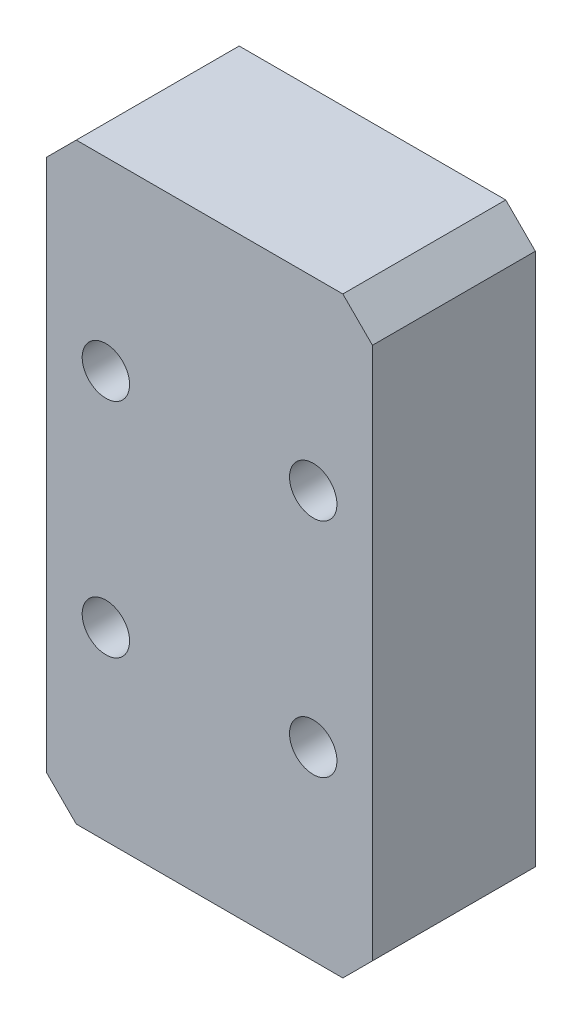
ISO-10303-21;
HEADER;
FILE_DESCRIPTION(('STEP AP214'),'2;1');
FILE_NAME('part.step','',(''),(''),'','','');
FILE_SCHEMA(('AUTOMOTIVE_DESIGN { 1 0 10303 214 1 1 1 1 }'));
ENDSEC;
DATA;
#1=APPLICATION_CONTEXT('core data for automotive mechanical design processes');
#2=APPLICATION_PROTOCOL_DEFINITION('international standard','automotive_design',2000,#1);
#3=PRODUCT_CONTEXT('',#1,'mechanical');
#4=PRODUCT('Part','Part','',(#3));
#5=PRODUCT_RELATED_PRODUCT_CATEGORY('part','',(#4));
#6=PRODUCT_DEFINITION_FORMATION('','',#4);
#7=PRODUCT_DEFINITION_CONTEXT('part definition',#1,'design');
#8=PRODUCT_DEFINITION('design','',#6,#7);
#9=PRODUCT_DEFINITION_SHAPE('','',#8);
#10=(LENGTH_UNIT() NAMED_UNIT(*) SI_UNIT(.MILLI.,.METRE.));
#11=(NAMED_UNIT(*) PLANE_ANGLE_UNIT() SI_UNIT($,.RADIAN.));
#12=(NAMED_UNIT(*) SI_UNIT($,.STERADIAN.) SOLID_ANGLE_UNIT());
#13=UNCERTAINTY_MEASURE_WITH_UNIT(LENGTH_MEASURE(1.E-05),#10,'distance_accuracy_value','');
#14=(GEOMETRIC_REPRESENTATION_CONTEXT(3) GLOBAL_UNCERTAINTY_ASSIGNED_CONTEXT((#13)) GLOBAL_UNIT_ASSIGNED_CONTEXT((#10,
#11,#12)) REPRESENTATION_CONTEXT('',''));
#15=CARTESIAN_POINT('',(0.,0.,0.));
#16=DIRECTION('',(0.,0.,1.));
#17=DIRECTION('',(1.,0.,0.));
#18=AXIS2_PLACEMENT_3D('',#15,#16,#17);
#19=CARTESIAN_POINT('',(7.,-7.5,0.));
#20=DIRECTION('',(0.,0.,1.));
#21=DIRECTION('',(1.,0.,0.));
#22=AXIS2_PLACEMENT_3D('',#19,#20,#21);
#23=CYLINDRICAL_SURFACE('',#22,1.6);
#24=CARTESIAN_POINT('',(7.,-7.5,0.));
#25=DIRECTION('',(0.,0.,1.));
#26=DIRECTION('',(1.,0.,0.));
#27=AXIS2_PLACEMENT_3D('',#24,#25,#26);
#28=CIRCLE('',#27,1.6);
#29=CARTESIAN_POINT('',(8.6,-7.5,0.));
#30=VERTEX_POINT('',#29);
#31=EDGE_CURVE('E147',#30,#30,#28,.T.);
#32=ORIENTED_EDGE('',*,*,#31,.F.);
#33=EDGE_LOOP('',(#32));
#34=FACE_BOUND('',#33,.T.);
#35=CARTESIAN_POINT('',(7.,-7.5,11.));
#36=DIRECTION('',(0.,0.,1.));
#37=DIRECTION('',(1.,0.,0.));
#38=AXIS2_PLACEMENT_3D('',#35,#36,#37);
#39=CIRCLE('',#38,1.6);
#40=CARTESIAN_POINT('',(8.6,-7.5,11.));
#41=VERTEX_POINT('',#40);
#42=EDGE_CURVE('E150',#41,#41,#39,.T.);
#43=ORIENTED_EDGE('',*,*,#42,.T.);
#44=EDGE_LOOP('',(#43));
#45=FACE_BOUND('',#44,.T.);
#46=ADVANCED_FACE('F32',(#34,#45),#23,.F.);
#47=CARTESIAN_POINT('',(-7.,-7.5,0.));
#48=DIRECTION('',(0.,0.,1.));
#49=DIRECTION('',(1.,0.,0.));
#50=AXIS2_PLACEMENT_3D('',#47,#48,#49);
#51=CYLINDRICAL_SURFACE('',#50,1.6);
#52=CARTESIAN_POINT('',(-7.,-7.5,0.));
#53=DIRECTION('',(0.,0.,1.));
#54=DIRECTION('',(1.,0.,0.));
#55=AXIS2_PLACEMENT_3D('',#52,#53,#54);
#56=CIRCLE('',#55,1.6);
#57=CARTESIAN_POINT('',(-5.4,-7.5,0.));
#58=VERTEX_POINT('',#57);
#59=EDGE_CURVE('E141',#58,#58,#56,.T.);
#60=ORIENTED_EDGE('',*,*,#59,.F.);
#61=EDGE_LOOP('',(#60));
#62=FACE_BOUND('',#61,.T.);
#63=CARTESIAN_POINT('',(-7.,-7.5,11.));
#64=DIRECTION('',(0.,0.,1.));
#65=DIRECTION('',(1.,0.,0.));
#66=AXIS2_PLACEMENT_3D('',#63,#64,#65);
#67=CIRCLE('',#66,1.6);
#68=CARTESIAN_POINT('',(-5.4,-7.5,11.));
#69=VERTEX_POINT('',#68);
#70=EDGE_CURVE('E144',#69,#69,#67,.T.);
#71=ORIENTED_EDGE('',*,*,#70,.T.);
#72=EDGE_LOOP('',(#71));
#73=FACE_BOUND('',#72,.T.);
#74=ADVANCED_FACE('F222',(#62,#73),#51,.F.);
#75=CARTESIAN_POINT('',(11.,-20.,11.));
#76=DIRECTION('',(-1.,0.,0.));
#77=DIRECTION('',(0.,0.,1.));
#78=AXIS2_PLACEMENT_3D('',#75,#76,#77);
#79=PLANE('',#78);
#80=DIRECTION('',(0.,1.,0.));
#81=VECTOR('',#80,1.);
#82=CARTESIAN_POINT('',(11.,-20.,11.));
#83=LINE('',#82,#81);
#84=CARTESIAN_POINT('',(11.,-18.,11.));
#85=VERTEX_POINT('',#84);
#86=CARTESIAN_POINT('',(11.,18.,11.));
#87=VERTEX_POINT('',#86);
#88=EDGE_CURVE('E118',#85,#87,#83,.T.);
#89=ORIENTED_EDGE('',*,*,#88,.F.);
#90=DIRECTION('',(0.,0.,-1.));
#91=VECTOR('',#90,1.);
#92=CARTESIAN_POINT('',(11.,-18.,11.));
#93=LINE('',#92,#91);
#94=CARTESIAN_POINT('',(11.,-18.,0.));
#95=VERTEX_POINT('',#94);
#96=EDGE_CURVE('E102',#85,#95,#93,.T.);
#97=ORIENTED_EDGE('',*,*,#96,.T.);
#98=DIRECTION('',(0.,1.,0.));
#99=VECTOR('',#98,1.);
#100=CARTESIAN_POINT('',(11.,-20.,0.));
#101=LINE('',#100,#99);
#102=CARTESIAN_POINT('',(11.,18.,0.));
#103=VERTEX_POINT('',#102);
#104=EDGE_CURVE('E115',#95,#103,#101,.T.);
#105=ORIENTED_EDGE('',*,*,#104,.T.);
#106=DIRECTION('',(0.,0.,1.));
#107=VECTOR('',#106,1.);
#108=CARTESIAN_POINT('',(11.,18.,11.));
#109=LINE('',#108,#107);
#110=EDGE_CURVE('E120',#103,#87,#109,.T.);
#111=ORIENTED_EDGE('',*,*,#110,.T.);
#112=EDGE_LOOP('',(#89,#97,#105,#111));
#113=FACE_BOUND('',#112,.T.);
#114=ADVANCED_FACE('F114',(#113),#79,.F.);
#115=CARTESIAN_POINT('',(-11.,20.,11.));
#116=DIRECTION('',(0.,-1.,0.));
#117=DIRECTION('',(0.,0.,-1.));
#118=AXIS2_PLACEMENT_3D('',#115,#116,#117);
#119=PLANE('',#118);
#120=DIRECTION('',(-1.,0.,0.));
#121=VECTOR('',#120,1.);
#122=CARTESIAN_POINT('',(-11.,20.,0.));
#123=LINE('',#122,#121);
#124=CARTESIAN_POINT('',(9.,20.,0.));
#125=VERTEX_POINT('',#124);
#126=CARTESIAN_POINT('',(-8.99999999999998,20.,0.));
#127=VERTEX_POINT('',#126);
#128=EDGE_CURVE('E125',#125,#127,#123,.T.);
#129=ORIENTED_EDGE('',*,*,#128,.T.);
#130=DIRECTION('',(0.,0.,1.));
#131=VECTOR('',#130,1.);
#132=CARTESIAN_POINT('',(-8.99999999999998,20.,11.));
#133=LINE('',#132,#131);
#134=CARTESIAN_POINT('',(-8.99999999999998,20.,11.));
#135=VERTEX_POINT('',#134);
#136=EDGE_CURVE('E11',#127,#135,#133,.T.);
#137=ORIENTED_EDGE('',*,*,#136,.T.);
#138=DIRECTION('',(-1.,0.,0.));
#139=VECTOR('',#138,1.);
#140=CARTESIAN_POINT('',(-11.,20.,11.));
#141=LINE('',#140,#139);
#142=CARTESIAN_POINT('',(9.,20.,11.));
#143=VERTEX_POINT('',#142);
#144=EDGE_CURVE('E177',#143,#135,#141,.T.);
#145=ORIENTED_EDGE('',*,*,#144,.F.);
#146=DIRECTION('',(0.,0.,-1.));
#147=VECTOR('',#146,1.);
#148=CARTESIAN_POINT('',(9.,20.,11.));
#149=LINE('',#148,#147);
#150=EDGE_CURVE('E40',#143,#125,#149,.T.);
#151=ORIENTED_EDGE('',*,*,#150,.T.);
#152=EDGE_LOOP('',(#129,#137,#145,#151));
#153=FACE_BOUND('',#152,.T.);
#154=ADVANCED_FACE('F175',(#153),#119,.F.);
#155=CARTESIAN_POINT('',(-11.,-20.,11.));
#156=DIRECTION('',(1.,0.,0.));
#157=DIRECTION('',(0.,0.,-1.));
#158=AXIS2_PLACEMENT_3D('',#155,#156,#157);
#159=PLANE('',#158);
#160=DIRECTION('',(0.,-1.,0.));
#161=VECTOR('',#160,1.);
#162=CARTESIAN_POINT('',(-11.,-20.,0.));
#163=LINE('',#162,#161);
#164=CARTESIAN_POINT('',(-11.,18.,0.));
#165=VERTEX_POINT('',#164);
#166=CARTESIAN_POINT('',(-11.,-18.,0.));
#167=VERTEX_POINT('',#166);
#168=EDGE_CURVE('E129',#165,#167,#163,.T.);
#169=ORIENTED_EDGE('',*,*,#168,.T.);
#170=DIRECTION('',(0.,0.,1.));
#171=VECTOR('',#170,1.);
#172=CARTESIAN_POINT('',(-11.,-18.,11.));
#173=LINE('',#172,#171);
#174=CARTESIAN_POINT('',(-11.,-18.,11.));
#175=VERTEX_POINT('',#174);
#176=EDGE_CURVE('E47',#167,#175,#173,.T.);
#177=ORIENTED_EDGE('',*,*,#176,.T.);
#178=DIRECTION('',(0.,-1.,0.));
#179=VECTOR('',#178,1.);
#180=CARTESIAN_POINT('',(-11.,-20.,11.));
#181=LINE('',#180,#179);
#182=CARTESIAN_POINT('',(-11.,18.,11.));
#183=VERTEX_POINT('',#182);
#184=EDGE_CURVE('E185',#183,#175,#181,.T.);
#185=ORIENTED_EDGE('',*,*,#184,.F.);
#186=DIRECTION('',(0.,0.,-1.));
#187=VECTOR('',#186,1.);
#188=CARTESIAN_POINT('',(-11.,18.,11.));
#189=LINE('',#188,#187);
#190=EDGE_CURVE('E168',#183,#165,#189,.T.);
#191=ORIENTED_EDGE('',*,*,#190,.T.);
#192=EDGE_LOOP('',(#169,#177,#185,#191));
#193=FACE_BOUND('',#192,.T.);
#194=ADVANCED_FACE('F184',(#193),#159,.F.);
#195=CARTESIAN_POINT('',(-11.,-20.,11.));
#196=DIRECTION('',(0.,1.,0.));
#197=DIRECTION('',(0.,0.,1.));
#198=AXIS2_PLACEMENT_3D('',#195,#196,#197);
#199=PLANE('',#198);
#200=DIRECTION('',(1.,0.,0.));
#201=VECTOR('',#200,1.);
#202=CARTESIAN_POINT('',(-11.,-20.,0.));
#203=LINE('',#202,#201);
#204=CARTESIAN_POINT('',(-9.,-20.,0.));
#205=VERTEX_POINT('',#204);
#206=CARTESIAN_POINT('',(8.99999999999999,-20.,0.));
#207=VERTEX_POINT('',#206);
#208=EDGE_CURVE('E139',#205,#207,#203,.T.);
#209=ORIENTED_EDGE('',*,*,#208,.T.);
#210=DIRECTION('',(0.,0.,1.));
#211=VECTOR('',#210,1.);
#212=CARTESIAN_POINT('',(8.99999999999999,-20.,11.));
#213=LINE('',#212,#211);
#214=CARTESIAN_POINT('',(8.99999999999999,-20.,11.));
#215=VERTEX_POINT('',#214);
#216=EDGE_CURVE('E103',#207,#215,#213,.T.);
#217=ORIENTED_EDGE('',*,*,#216,.T.);
#218=DIRECTION('',(1.,0.,0.));
#219=VECTOR('',#218,1.);
#220=CARTESIAN_POINT('',(-11.,-20.,11.));
#221=LINE('',#220,#219);
#222=CARTESIAN_POINT('',(-9.,-20.,11.));
#223=VERTEX_POINT('',#222);
#224=EDGE_CURVE('E135',#223,#215,#221,.T.);
#225=ORIENTED_EDGE('',*,*,#224,.F.);
#226=DIRECTION('',(0.,0.,-1.));
#227=VECTOR('',#226,1.);
#228=CARTESIAN_POINT('',(-9.,-20.,11.));
#229=LINE('',#228,#227);
#230=EDGE_CURVE('E108',#223,#205,#229,.T.);
#231=ORIENTED_EDGE('',*,*,#230,.T.);
#232=EDGE_LOOP('',(#209,#217,#225,#231));
#233=FACE_BOUND('',#232,.T.);
#234=ADVANCED_FACE('F212',(#233),#199,.F.);
#235=CARTESIAN_POINT('',(0.,0.,11.));
#236=DIRECTION('',(0.,0.,-1.));
#237=DIRECTION('',(-1.,0.,0.));
#238=AXIS2_PLACEMENT_3D('',#235,#236,#237);
#239=PLANE('',#238);
#240=CARTESIAN_POINT('',(7.,7.5,11.));
#241=DIRECTION('',(0.,0.,1.));
#242=DIRECTION('',(1.,0.,0.));
#243=AXIS2_PLACEMENT_3D('',#240,#241,#242);
#244=CIRCLE('',#243,1.6);
#245=CARTESIAN_POINT('',(8.6,7.5,11.));
#246=VERTEX_POINT('',#245);
#247=EDGE_CURVE('E192',#246,#246,#244,.T.);
#248=ORIENTED_EDGE('',*,*,#247,.F.);
#249=EDGE_LOOP('',(#248));
#250=FACE_BOUND('',#249,.T.);
#251=CARTESIAN_POINT('',(-7.,7.5,11.));
#252=DIRECTION('',(0.,0.,1.));
#253=DIRECTION('',(1.,0.,0.));
#254=AXIS2_PLACEMENT_3D('',#251,#252,#253);
#255=CIRCLE('',#254,1.6);
#256=CARTESIAN_POINT('',(-5.4,7.5,11.));
#257=VERTEX_POINT('',#256);
#258=EDGE_CURVE('E132',#257,#257,#255,.T.);
#259=ORIENTED_EDGE('',*,*,#258,.F.);
#260=EDGE_LOOP('',(#259));
#261=FACE_BOUND('',#260,.T.);
#262=ORIENTED_EDGE('',*,*,#224,.T.);
#263=DIRECTION('',(-0.70710678118655,-0.707106781186545,0.));
#264=VECTOR('',#263,1.);
#265=CARTESIAN_POINT('',(11.,-18.,11.));
#266=LINE('',#265,#264);
#267=EDGE_CURVE('E166',#215,#85,#266,.F.);
#268=ORIENTED_EDGE('',*,*,#267,.T.);
#269=ORIENTED_EDGE('',*,*,#88,.T.);
#270=DIRECTION('',(0.707106781186545,-0.70710678118655,0.));
#271=VECTOR('',#270,1.);
#272=CARTESIAN_POINT('',(9.,20.,11.));
#273=LINE('',#272,#271);
#274=EDGE_CURVE('E161',#87,#143,#273,.F.);
#275=ORIENTED_EDGE('',*,*,#274,.T.);
#276=ORIENTED_EDGE('',*,*,#144,.T.);
#277=DIRECTION('',(0.70710678118655,0.707106781186545,0.));
#278=VECTOR('',#277,1.);
#279=CARTESIAN_POINT('',(-11.,18.,11.));
#280=LINE('',#279,#278);
#281=EDGE_CURVE('E54',#135,#183,#280,.F.);
#282=ORIENTED_EDGE('',*,*,#281,.T.);
#283=ORIENTED_EDGE('',*,*,#184,.T.);
#284=DIRECTION('',(-0.707106781186545,0.70710678118655,0.));
#285=VECTOR('',#284,1.);
#286=CARTESIAN_POINT('',(-9.,-20.,11.));
#287=LINE('',#286,#285);
#288=EDGE_CURVE('E164',#175,#223,#287,.F.);
#289=ORIENTED_EDGE('',*,*,#288,.T.);
#290=EDGE_LOOP('',(#262,#268,#269,#275,#276,#282,#283,#289));
#291=FACE_BOUND('',#290,.T.);
#292=ORIENTED_EDGE('',*,*,#70,.F.);
#293=EDGE_LOOP('',(#292));
#294=FACE_BOUND('',#293,.T.);
#295=ORIENTED_EDGE('',*,*,#42,.F.);
#296=EDGE_LOOP('',(#295));
#297=FACE_BOUND('',#296,.T.);
#298=ADVANCED_FACE('F209',(#250,#261,#291,#294,#297),#239,.F.);
#299=CARTESIAN_POINT('',(0.,0.,0.));
#300=DIRECTION('',(0.,0.,-1.));
#301=DIRECTION('',(-1.,0.,0.));
#302=AXIS2_PLACEMENT_3D('',#299,#300,#301);
#303=PLANE('',#302);
#304=CARTESIAN_POINT('',(7.,7.5,0.));
#305=DIRECTION('',(0.,0.,1.));
#306=DIRECTION('',(1.,0.,0.));
#307=AXIS2_PLACEMENT_3D('',#304,#305,#306);
#308=CIRCLE('',#307,1.6);
#309=CARTESIAN_POINT('',(8.6,7.5,0.));
#310=VERTEX_POINT('',#309);
#311=EDGE_CURVE('E196',#310,#310,#308,.T.);
#312=ORIENTED_EDGE('',*,*,#311,.T.);
#313=EDGE_LOOP('',(#312));
#314=FACE_BOUND('',#313,.T.);
#315=CARTESIAN_POINT('',(-7.,7.5,0.));
#316=DIRECTION('',(0.,0.,1.));
#317=DIRECTION('',(1.,0.,0.));
#318=AXIS2_PLACEMENT_3D('',#315,#316,#317);
#319=CIRCLE('',#318,1.6);
#320=CARTESIAN_POINT('',(-5.4,7.5,0.));
#321=VERTEX_POINT('',#320);
#322=EDGE_CURVE('E126',#321,#321,#319,.T.);
#323=ORIENTED_EDGE('',*,*,#322,.T.);
#324=EDGE_LOOP('',(#323));
#325=FACE_BOUND('',#324,.T.);
#326=ORIENTED_EDGE('',*,*,#104,.F.);
#327=DIRECTION('',(0.70710678118655,0.707106781186545,0.));
#328=VECTOR('',#327,1.);
#329=CARTESIAN_POINT('',(14.5,-14.5000000000001,0.));
#330=LINE('',#329,#328);
#331=EDGE_CURVE('E98',#95,#207,#330,.F.);
#332=ORIENTED_EDGE('',*,*,#331,.T.);
#333=ORIENTED_EDGE('',*,*,#208,.F.);
#334=DIRECTION('',(0.707106781186545,-0.70710678118655,0.));
#335=VECTOR('',#334,1.);
#336=CARTESIAN_POINT('',(-14.5,-14.4999999999999,0.));
#337=LINE('',#336,#335);
#338=EDGE_CURVE('E109',#205,#167,#337,.F.);
#339=ORIENTED_EDGE('',*,*,#338,.T.);
#340=ORIENTED_EDGE('',*,*,#168,.F.);
#341=DIRECTION('',(-0.70710678118655,-0.707106781186545,0.));
#342=VECTOR('',#341,1.);
#343=CARTESIAN_POINT('',(-14.5,14.5000000000001,0.));
#344=LINE('',#343,#342);
#345=EDGE_CURVE('E155',#165,#127,#344,.F.);
#346=ORIENTED_EDGE('',*,*,#345,.T.);
#347=ORIENTED_EDGE('',*,*,#128,.F.);
#348=DIRECTION('',(-0.707106781186545,0.70710678118655,0.));
#349=VECTOR('',#348,1.);
#350=CARTESIAN_POINT('',(14.5,14.4999999999999,0.));
#351=LINE('',#350,#349);
#352=EDGE_CURVE('E119',#125,#103,#351,.F.);
#353=ORIENTED_EDGE('',*,*,#352,.T.);
#354=EDGE_LOOP('',(#326,#332,#333,#339,#340,#346,#347,#353));
#355=FACE_BOUND('',#354,.T.);
#356=ORIENTED_EDGE('',*,*,#59,.T.);
#357=EDGE_LOOP('',(#356));
#358=FACE_BOUND('',#357,.T.);
#359=ORIENTED_EDGE('',*,*,#31,.T.);
#360=EDGE_LOOP('',(#359));
#361=FACE_BOUND('',#360,.T.);
#362=ADVANCED_FACE('F122',(#314,#325,#355,#358,#361),#303,.T.);
#363=CARTESIAN_POINT('',(-7.,7.5,0.));
#364=DIRECTION('',(0.,0.,1.));
#365=DIRECTION('',(1.,0.,0.));
#366=AXIS2_PLACEMENT_3D('',#363,#364,#365);
#367=CYLINDRICAL_SURFACE('',#366,1.6);
#368=ORIENTED_EDGE('',*,*,#322,.F.);
#369=EDGE_LOOP('',(#368));
#370=FACE_BOUND('',#369,.T.);
#371=ORIENTED_EDGE('',*,*,#258,.T.);
#372=EDGE_LOOP('',(#371));
#373=FACE_BOUND('',#372,.T.);
#374=ADVANCED_FACE('F205',(#370,#373),#367,.F.);
#375=CARTESIAN_POINT('',(7.,7.5,0.));
#376=DIRECTION('',(0.,0.,1.));
#377=DIRECTION('',(1.,0.,0.));
#378=AXIS2_PLACEMENT_3D('',#375,#376,#377);
#379=CYLINDRICAL_SURFACE('',#378,1.6);
#380=ORIENTED_EDGE('',*,*,#311,.F.);
#381=EDGE_LOOP('',(#380));
#382=FACE_BOUND('',#381,.T.);
#383=ORIENTED_EDGE('',*,*,#247,.T.);
#384=EDGE_LOOP('',(#383));
#385=FACE_BOUND('',#384,.T.);
#386=ADVANCED_FACE('F202',(#382,#385),#379,.F.);
#387=CARTESIAN_POINT('',(11.,-18.,11.));
#388=DIRECTION('',(-0.707106781186545,0.70710678118655,0.));
#389=DIRECTION('',(0.,0.,-1.));
#390=AXIS2_PLACEMENT_3D('',#387,#388,#389);
#391=PLANE('',#390);
#392=ORIENTED_EDGE('',*,*,#267,.F.);
#393=ORIENTED_EDGE('',*,*,#216,.F.);
#394=ORIENTED_EDGE('',*,*,#331,.F.);
#395=ORIENTED_EDGE('',*,*,#96,.F.);
#396=EDGE_LOOP('',(#392,#393,#394,#395));
#397=FACE_BOUND('',#396,.T.);
#398=ADVANCED_FACE('F101',(#397),#391,.F.);
#399=CARTESIAN_POINT('',(-9.,-20.,11.));
#400=DIRECTION('',(0.70710678118655,0.707106781186545,0.));
#401=DIRECTION('',(0.,0.,-1.));
#402=AXIS2_PLACEMENT_3D('',#399,#400,#401);
#403=PLANE('',#402);
#404=ORIENTED_EDGE('',*,*,#288,.F.);
#405=ORIENTED_EDGE('',*,*,#176,.F.);
#406=ORIENTED_EDGE('',*,*,#338,.F.);
#407=ORIENTED_EDGE('',*,*,#230,.F.);
#408=EDGE_LOOP('',(#404,#405,#406,#407));
#409=FACE_BOUND('',#408,.T.);
#410=ADVANCED_FACE('F235',(#409),#403,.F.);
#411=CARTESIAN_POINT('',(-11.,18.,11.));
#412=DIRECTION('',(0.707106781186545,-0.70710678118655,0.));
#413=DIRECTION('',(0.,0.,-1.));
#414=AXIS2_PLACEMENT_3D('',#411,#412,#413);
#415=PLANE('',#414);
#416=ORIENTED_EDGE('',*,*,#281,.F.);
#417=ORIENTED_EDGE('',*,*,#136,.F.);
#418=ORIENTED_EDGE('',*,*,#345,.F.);
#419=ORIENTED_EDGE('',*,*,#190,.F.);
#420=EDGE_LOOP('',(#416,#417,#418,#419));
#421=FACE_BOUND('',#420,.T.);
#422=ADVANCED_FACE('F183',(#421),#415,.F.);
#423=CARTESIAN_POINT('',(9.,20.,11.));
#424=DIRECTION('',(-0.70710678118655,-0.707106781186545,0.));
#425=DIRECTION('',(0.,0.,-1.));
#426=AXIS2_PLACEMENT_3D('',#423,#424,#425);
#427=PLANE('',#426);
#428=ORIENTED_EDGE('',*,*,#274,.F.);
#429=ORIENTED_EDGE('',*,*,#110,.F.);
#430=ORIENTED_EDGE('',*,*,#352,.F.);
#431=ORIENTED_EDGE('',*,*,#150,.F.);
#432=EDGE_LOOP('',(#428,#429,#430,#431));
#433=FACE_BOUND('',#432,.T.);
#434=ADVANCED_FACE('F34',(#433),#427,.F.);
#435=CLOSED_SHELL('',(#46,#74,#114,#154,#194,#234,#298,#362,#374,#386,#398,#410,#422,#434));
#436=MANIFOLD_SOLID_BREP('B2',#435);
#437=ADVANCED_BREP_SHAPE_REPRESENTATION('',(#18,#436),#14);
#438=SHAPE_DEFINITION_REPRESENTATION(#9,#437);
ENDSEC;
END-ISO-10303-21;
